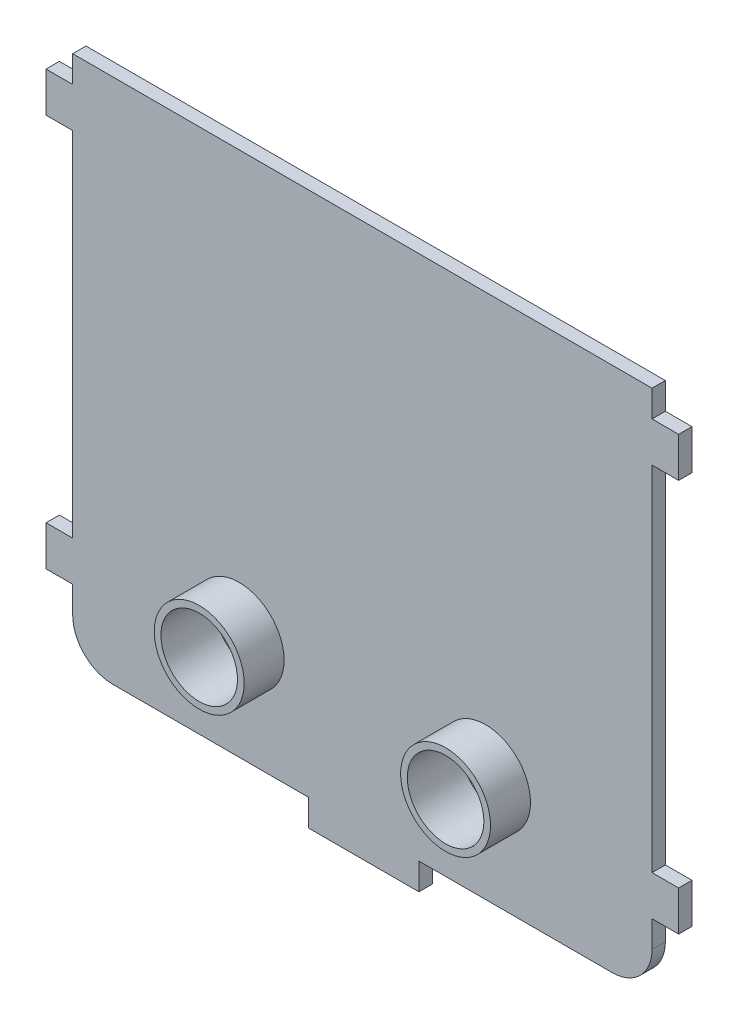
ISO-10303-21;
HEADER;
FILE_DESCRIPTION(('STEP AP214'),'2;1');
FILE_NAME('part.step','',(''),(''),'','','');
FILE_SCHEMA(('AUTOMOTIVE_DESIGN { 1 0 10303 214 1 1 1 1 }'));
ENDSEC;
DATA;
#1=APPLICATION_CONTEXT('core data for automotive mechanical design processes');
#2=APPLICATION_PROTOCOL_DEFINITION('international standard','automotive_design',2000,#1);
#3=PRODUCT_CONTEXT('',#1,'mechanical');
#4=PRODUCT('Part','Part','',(#3));
#5=PRODUCT_RELATED_PRODUCT_CATEGORY('part','',(#4));
#6=PRODUCT_DEFINITION_FORMATION('','',#4);
#7=PRODUCT_DEFINITION_CONTEXT('part definition',#1,'design');
#8=PRODUCT_DEFINITION('design','',#6,#7);
#9=PRODUCT_DEFINITION_SHAPE('','',#8);
#10=(LENGTH_UNIT() NAMED_UNIT(*) SI_UNIT(.MILLI.,.METRE.));
#11=(NAMED_UNIT(*) PLANE_ANGLE_UNIT() SI_UNIT($,.RADIAN.));
#12=(NAMED_UNIT(*) SI_UNIT($,.STERADIAN.) SOLID_ANGLE_UNIT());
#13=UNCERTAINTY_MEASURE_WITH_UNIT(LENGTH_MEASURE(1.E-05),#10,'distance_accuracy_value','');
#14=(GEOMETRIC_REPRESENTATION_CONTEXT(3) GLOBAL_UNCERTAINTY_ASSIGNED_CONTEXT((#13)) GLOBAL_UNIT_ASSIGNED_CONTEXT((#10,
#11,#12)) REPRESENTATION_CONTEXT('',''));
#15=CARTESIAN_POINT('',(0.,0.,0.));
#16=DIRECTION('',(0.,0.,1.));
#17=DIRECTION('',(1.,0.,0.));
#18=AXIS2_PLACEMENT_3D('',#15,#16,#17);
#19=CARTESIAN_POINT('',(21.75,-19.75,1.));
#20=DIRECTION('',(0.,1.,0.));
#21=DIRECTION('',(-1.,0.,0.));
#22=AXIS2_PLACEMENT_3D('',#19,#20,#21);
#23=PLANE('',#22);
#24=DIRECTION('',(1.,0.,0.));
#25=VECTOR('',#24,1.);
#26=CARTESIAN_POINT('',(21.75,-19.75,1.));
#27=LINE('',#26,#25);
#28=CARTESIAN_POINT('',(-18.75,-19.75,1.));
#29=VERTEX_POINT('',#28);
#30=CARTESIAN_POINT('',(-4.04955642280387,-19.75,1.));
#31=VERTEX_POINT('',#30);
#32=EDGE_CURVE('E352',#29,#31,#27,.T.);
#33=ORIENTED_EDGE('',*,*,#32,.F.);
#34=DIRECTION('',(0.,0.,-1.));
#35=VECTOR('',#34,1.);
#36=CARTESIAN_POINT('',(-18.75,-19.75,1.));
#37=LINE('',#36,#35);
#38=CARTESIAN_POINT('',(-18.75,-19.75,0.));
#39=VERTEX_POINT('',#38);
#40=EDGE_CURVE('E378',#29,#39,#37,.T.);
#41=ORIENTED_EDGE('',*,*,#40,.T.);
#42=DIRECTION('',(1.,0.,0.));
#43=VECTOR('',#42,1.);
#44=CARTESIAN_POINT('',(21.75,-19.75,0.));
#45=LINE('',#44,#43);
#46=CARTESIAN_POINT('',(-4.04955642280387,-19.75,0.));
#47=VERTEX_POINT('',#46);
#48=EDGE_CURVE('E365',#39,#47,#45,.T.);
#49=ORIENTED_EDGE('',*,*,#48,.T.);
#50=DIRECTION('',(0.,0.,-1.));
#51=VECTOR('',#50,1.);
#52=CARTESIAN_POINT('',(-4.04955642280387,-19.75,1.));
#53=LINE('',#52,#51);
#54=EDGE_CURVE('E231',#31,#47,#53,.T.);
#55=ORIENTED_EDGE('',*,*,#54,.F.);
#56=EDGE_LOOP('',(#33,#41,#49,#55));
#57=FACE_BOUND('',#56,.T.);
#58=ADVANCED_FACE('F33',(#57),#23,.F.);
#59=CARTESIAN_POINT('',(4.24999999999999,-19.75,0.));
#60=VERTEX_POINT('',#59);
#61=CARTESIAN_POINT('',(18.75,-19.75,0.));
#62=VERTEX_POINT('',#61);
#63=EDGE_CURVE('E363',#60,#62,#45,.T.);
#64=ORIENTED_EDGE('',*,*,#63,.T.);
#65=DIRECTION('',(0.,0.,-1.));
#66=VECTOR('',#65,1.);
#67=CARTESIAN_POINT('',(18.75,-19.75,1.));
#68=LINE('',#67,#66);
#69=CARTESIAN_POINT('',(18.75,-19.75,1.));
#70=VERTEX_POINT('',#69);
#71=EDGE_CURVE('E11',#62,#70,#68,.F.);
#72=ORIENTED_EDGE('',*,*,#71,.T.);
#73=CARTESIAN_POINT('',(4.24999999999999,-19.75,1.));
#74=VERTEX_POINT('',#73);
#75=EDGE_CURVE('E349',#74,#70,#27,.T.);
#76=ORIENTED_EDGE('',*,*,#75,.F.);
#77=DIRECTION('',(0.,0.,1.));
#78=VECTOR('',#77,1.);
#79=CARTESIAN_POINT('',(4.24999999999999,-19.75,1.));
#80=LINE('',#79,#78);
#81=EDGE_CURVE('E227',#60,#74,#80,.T.);
#82=ORIENTED_EDGE('',*,*,#81,.F.);
#83=EDGE_LOOP('',(#64,#72,#76,#82));
#84=FACE_BOUND('',#83,.T.);
#85=ADVANCED_FACE('F481',(#84),#23,.F.);
#86=CARTESIAN_POINT('',(-21.75,-19.75,1.));
#87=DIRECTION('',(1.,0.,0.));
#88=DIRECTION('',(0.,0.,-1.));
#89=AXIS2_PLACEMENT_3D('',#86,#87,#88);
#90=PLANE('',#89);
#91=DIRECTION('',(0.,0.,1.));
#92=VECTOR('',#91,1.);
#93=CARTESIAN_POINT('',(-21.75,14.75,0.));
#94=LINE('',#93,#92);
#95=CARTESIAN_POINT('',(-21.75,14.75,0.));
#96=VERTEX_POINT('',#95);
#97=CARTESIAN_POINT('',(-21.75,14.75,1.));
#98=VERTEX_POINT('',#97);
#99=EDGE_CURVE('E232',#96,#98,#94,.T.);
#100=ORIENTED_EDGE('',*,*,#99,.F.);
#101=DIRECTION('',(0.,-1.,0.));
#102=VECTOR('',#101,1.);
#103=CARTESIAN_POINT('',(-21.75,-19.75,0.));
#104=LINE('',#103,#102);
#105=CARTESIAN_POINT('',(-21.75,-11.75,0.));
#106=VERTEX_POINT('',#105);
#107=EDGE_CURVE('E364',#96,#106,#104,.T.);
#108=ORIENTED_EDGE('',*,*,#107,.T.);
#109=DIRECTION('',(0.,0.,-1.));
#110=VECTOR('',#109,1.);
#111=CARTESIAN_POINT('',(-21.75,-11.75,0.));
#112=LINE('',#111,#110);
#113=CARTESIAN_POINT('',(-21.75,-11.75,1.));
#114=VERTEX_POINT('',#113);
#115=EDGE_CURVE('E269',#114,#106,#112,.T.);
#116=ORIENTED_EDGE('',*,*,#115,.F.);
#117=DIRECTION('',(0.,-1.,0.));
#118=VECTOR('',#117,1.);
#119=CARTESIAN_POINT('',(-21.75,-19.75,1.));
#120=LINE('',#119,#118);
#121=EDGE_CURVE('E350',#98,#114,#120,.T.);
#122=ORIENTED_EDGE('',*,*,#121,.F.);
#123=EDGE_LOOP('',(#100,#108,#116,#122));
#124=FACE_BOUND('',#123,.T.);
#125=ADVANCED_FACE('F448',(#124),#90,.F.);
#126=DIRECTION('',(0.,0.,-1.));
#127=VECTOR('',#126,1.);
#128=CARTESIAN_POINT('',(-21.75,17.75,0.));
#129=LINE('',#128,#127);
#130=CARTESIAN_POINT('',(-21.75,17.75,1.));
#131=VERTEX_POINT('',#130);
#132=CARTESIAN_POINT('',(-21.75,17.75,0.));
#133=VERTEX_POINT('',#132);
#134=EDGE_CURVE('E235',#131,#133,#129,.T.);
#135=ORIENTED_EDGE('',*,*,#134,.F.);
#136=CARTESIAN_POINT('',(-21.75,19.75,1.));
#137=VERTEX_POINT('',#136);
#138=EDGE_CURVE('E346',#137,#131,#120,.T.);
#139=ORIENTED_EDGE('',*,*,#138,.F.);
#140=DIRECTION('',(0.,0.,-1.));
#141=VECTOR('',#140,1.);
#142=CARTESIAN_POINT('',(-21.75,19.75,1.));
#143=LINE('',#142,#141);
#144=CARTESIAN_POINT('',(-21.75,19.75,0.));
#145=VERTEX_POINT('',#144);
#146=EDGE_CURVE('E360',#137,#145,#143,.T.);
#147=ORIENTED_EDGE('',*,*,#146,.T.);
#148=EDGE_CURVE('E361',#145,#133,#104,.T.);
#149=ORIENTED_EDGE('',*,*,#148,.T.);
#150=EDGE_LOOP('',(#135,#139,#147,#149));
#151=FACE_BOUND('',#150,.T.);
#152=ADVANCED_FACE('F430',(#151),#90,.F.);
#153=CARTESIAN_POINT('',(-21.75,-14.75,0.));
#154=VERTEX_POINT('',#153);
#155=CARTESIAN_POINT('',(-21.75,-16.75,0.));
#156=VERTEX_POINT('',#155);
#157=EDGE_CURVE('E345',#154,#156,#104,.T.);
#158=ORIENTED_EDGE('',*,*,#157,.T.);
#159=DIRECTION('',(0.,0.,-1.));
#160=VECTOR('',#159,1.);
#161=CARTESIAN_POINT('',(-21.75,-16.75,1.));
#162=LINE('',#161,#160);
#163=CARTESIAN_POINT('',(-21.75,-16.75,1.));
#164=VERTEX_POINT('',#163);
#165=EDGE_CURVE('E385',#156,#164,#162,.F.);
#166=ORIENTED_EDGE('',*,*,#165,.T.);
#167=CARTESIAN_POINT('',(-21.75,-14.75,1.));
#168=VERTEX_POINT('',#167);
#169=EDGE_CURVE('E351',#168,#164,#120,.T.);
#170=ORIENTED_EDGE('',*,*,#169,.F.);
#171=DIRECTION('',(0.,0.,1.));
#172=VECTOR('',#171,1.);
#173=CARTESIAN_POINT('',(-21.75,-14.75,0.));
#174=LINE('',#173,#172);
#175=EDGE_CURVE('E264',#154,#168,#174,.T.);
#176=ORIENTED_EDGE('',*,*,#175,.F.);
#177=EDGE_LOOP('',(#158,#166,#170,#176));
#178=FACE_BOUND('',#177,.T.);
#179=ADVANCED_FACE('F462',(#178),#90,.F.);
#180=CARTESIAN_POINT('',(21.75,-19.75,1.));
#181=DIRECTION('',(-1.,0.,0.));
#182=DIRECTION('',(0.,0.,1.));
#183=AXIS2_PLACEMENT_3D('',#180,#181,#182);
#184=PLANE('',#183);
#185=DIRECTION('',(0.,1.,0.));
#186=VECTOR('',#185,1.);
#187=CARTESIAN_POINT('',(21.75,-19.75,1.));
#188=LINE('',#187,#186);
#189=CARTESIAN_POINT('',(21.75,-16.75,1.));
#190=VERTEX_POINT('',#189);
#191=CARTESIAN_POINT('',(21.75,-14.75,1.));
#192=VERTEX_POINT('',#191);
#193=EDGE_CURVE('E355',#190,#192,#188,.T.);
#194=ORIENTED_EDGE('',*,*,#193,.F.);
#195=DIRECTION('',(0.,0.,-1.));
#196=VECTOR('',#195,1.);
#197=CARTESIAN_POINT('',(21.75,-16.75,1.));
#198=LINE('',#197,#196);
#199=CARTESIAN_POINT('',(21.75,-16.75,0.));
#200=VERTEX_POINT('',#199);
#201=EDGE_CURVE('E41',#190,#200,#198,.T.);
#202=ORIENTED_EDGE('',*,*,#201,.T.);
#203=DIRECTION('',(0.,1.,0.));
#204=VECTOR('',#203,1.);
#205=CARTESIAN_POINT('',(21.75,-19.75,0.));
#206=LINE('',#205,#204);
#207=CARTESIAN_POINT('',(21.75,-14.75,0.));
#208=VERTEX_POINT('',#207);
#209=EDGE_CURVE('E368',#200,#208,#206,.T.);
#210=ORIENTED_EDGE('',*,*,#209,.T.);
#211=DIRECTION('',(0.,0.,-1.));
#212=VECTOR('',#211,1.);
#213=CARTESIAN_POINT('',(21.75,-14.75,1.));
#214=LINE('',#213,#212);
#215=EDGE_CURVE('E291',#192,#208,#214,.T.);
#216=ORIENTED_EDGE('',*,*,#215,.F.);
#217=EDGE_LOOP('',(#194,#202,#210,#216));
#218=FACE_BOUND('',#217,.T.);
#219=ADVANCED_FACE('F393',(#218),#184,.F.);
#220=DIRECTION('',(0.,0.,1.));
#221=VECTOR('',#220,1.);
#222=CARTESIAN_POINT('',(21.75,-11.75,1.));
#223=LINE('',#222,#221);
#224=CARTESIAN_POINT('',(21.75,-11.75,0.));
#225=VERTEX_POINT('',#224);
#226=CARTESIAN_POINT('',(21.75,-11.75,1.));
#227=VERTEX_POINT('',#226);
#228=EDGE_CURVE('E296',#225,#227,#223,.T.);
#229=ORIENTED_EDGE('',*,*,#228,.F.);
#230=CARTESIAN_POINT('',(21.75,14.75,0.));
#231=VERTEX_POINT('',#230);
#232=EDGE_CURVE('E371',#225,#231,#206,.T.);
#233=ORIENTED_EDGE('',*,*,#232,.T.);
#234=DIRECTION('',(0.,0.,-1.));
#235=VECTOR('',#234,1.);
#236=CARTESIAN_POINT('',(21.75,14.75,1.00000000000001));
#237=LINE('',#236,#235);
#238=CARTESIAN_POINT('',(21.75,14.75,1.));
#239=VERTEX_POINT('',#238);
#240=EDGE_CURVE('E318',#239,#231,#237,.T.);
#241=ORIENTED_EDGE('',*,*,#240,.F.);
#242=EDGE_CURVE('E358',#227,#239,#188,.T.);
#243=ORIENTED_EDGE('',*,*,#242,.F.);
#244=EDGE_LOOP('',(#229,#233,#241,#243));
#245=FACE_BOUND('',#244,.T.);
#246=ADVANCED_FACE('F413',(#245),#184,.F.);
#247=DIRECTION('',(0.,0.,1.));
#248=VECTOR('',#247,1.);
#249=CARTESIAN_POINT('',(21.75,17.75,1.00000000000001));
#250=LINE('',#249,#248);
#251=CARTESIAN_POINT('',(21.75,17.75,0.));
#252=VERTEX_POINT('',#251);
#253=CARTESIAN_POINT('',(21.75,17.75,1.));
#254=VERTEX_POINT('',#253);
#255=EDGE_CURVE('E323',#252,#254,#250,.T.);
#256=ORIENTED_EDGE('',*,*,#255,.F.);
#257=CARTESIAN_POINT('',(21.75,19.75,0.));
#258=VERTEX_POINT('',#257);
#259=EDGE_CURVE('E367',#252,#258,#206,.T.);
#260=ORIENTED_EDGE('',*,*,#259,.T.);
#261=DIRECTION('',(0.,0.,-1.));
#262=VECTOR('',#261,1.);
#263=CARTESIAN_POINT('',(21.75,19.75,1.));
#264=LINE('',#263,#262);
#265=CARTESIAN_POINT('',(21.75,19.75,1.));
#266=VERTEX_POINT('',#265);
#267=EDGE_CURVE('E375',#266,#258,#264,.T.);
#268=ORIENTED_EDGE('',*,*,#267,.F.);
#269=EDGE_CURVE('E354',#254,#266,#188,.T.);
#270=ORIENTED_EDGE('',*,*,#269,.F.);
#271=EDGE_LOOP('',(#256,#260,#268,#270));
#272=FACE_BOUND('',#271,.T.);
#273=ADVANCED_FACE('F422',(#272),#184,.F.);
#274=CARTESIAN_POINT('',(21.75,19.75,1.));
#275=DIRECTION('',(0.,-1.,0.));
#276=DIRECTION('',(1.,0.,0.));
#277=AXIS2_PLACEMENT_3D('',#274,#275,#276);
#278=PLANE('',#277);
#279=DIRECTION('',(-1.,0.,0.));
#280=VECTOR('',#279,1.);
#281=CARTESIAN_POINT('',(21.75,19.75,0.));
#282=LINE('',#281,#280);
#283=EDGE_CURVE('E370',#258,#145,#282,.T.);
#284=ORIENTED_EDGE('',*,*,#283,.T.);
#285=ORIENTED_EDGE('',*,*,#146,.F.);
#286=DIRECTION('',(-1.,0.,0.));
#287=VECTOR('',#286,1.);
#288=CARTESIAN_POINT('',(21.75,19.75,1.));
#289=LINE('',#288,#287);
#290=EDGE_CURVE('E357',#266,#137,#289,.T.);
#291=ORIENTED_EDGE('',*,*,#290,.F.);
#292=ORIENTED_EDGE('',*,*,#267,.T.);
#293=EDGE_LOOP('',(#284,#285,#291,#292));
#294=FACE_BOUND('',#293,.T.);
#295=ADVANCED_FACE('F426',(#294),#278,.F.);
#296=CARTESIAN_POINT('',(0.,0.,1.));
#297=DIRECTION('',(0.,0.,1.));
#298=DIRECTION('',(1.,0.,0.));
#299=AXIS2_PLACEMENT_3D('',#296,#297,#298);
#300=PLANE('',#299);
#301=CARTESIAN_POINT('',(-9.25046454215475,-11.75,1.));
#302=DIRECTION('',(0.,0.,1.));
#303=DIRECTION('',(1.,0.,0.));
#304=AXIS2_PLACEMENT_3D('',#301,#302,#303);
#305=CIRCLE('',#304,3.375);
#306=CARTESIAN_POINT('',(-5.87546454215475,-11.75,1.));
#307=VERTEX_POINT('',#306);
#308=EDGE_CURVE('E815',#307,#307,#305,.T.);
#309=ORIENTED_EDGE('',*,*,#308,.F.);
#310=EDGE_LOOP('',(#309));
#311=FACE_BOUND('',#310,.T.);
#312=CARTESIAN_POINT('',(9.25046454215474,-11.75,1.));
#313=DIRECTION('',(0.,0.,1.));
#314=DIRECTION('',(1.,0.,0.));
#315=AXIS2_PLACEMENT_3D('',#312,#313,#314);
#316=CIRCLE('',#315,3.375);
#317=CARTESIAN_POINT('',(12.6254645421547,-11.75,1.));
#318=VERTEX_POINT('',#317);
#319=EDGE_CURVE('E814',#318,#318,#316,.T.);
#320=ORIENTED_EDGE('',*,*,#319,.F.);
#321=EDGE_LOOP('',(#320));
#322=FACE_BOUND('',#321,.T.);
#323=ORIENTED_EDGE('',*,*,#169,.T.);
#324=CARTESIAN_POINT('',(-18.75,-16.75,1.));
#325=DIRECTION('',(0.,0.,1.));
#326=DIRECTION('',(1.,0.,0.));
#327=AXIS2_PLACEMENT_3D('',#324,#325,#326);
#328=CIRCLE('',#327,3.);
#329=EDGE_CURVE('E388',#164,#29,#328,.T.);
#330=ORIENTED_EDGE('',*,*,#329,.T.);
#331=ORIENTED_EDGE('',*,*,#32,.T.);
#332=DIRECTION('',(0.,1.,0.));
#333=VECTOR('',#332,1.);
#334=CARTESIAN_POINT('',(-4.04955642280387,-21.75,1.));
#335=LINE('',#334,#333);
#336=CARTESIAN_POINT('',(-4.04955642280387,-21.75,1.));
#337=VERTEX_POINT('',#336);
#338=EDGE_CURVE('E825',#337,#31,#335,.T.);
#339=ORIENTED_EDGE('',*,*,#338,.F.);
#340=DIRECTION('',(-1.,0.,0.));
#341=VECTOR('',#340,1.);
#342=CARTESIAN_POINT('',(-4.04955642280387,-21.75,1.));
#343=LINE('',#342,#341);
#344=CARTESIAN_POINT('',(4.24999999999999,-21.75,1.));
#345=VERTEX_POINT('',#344);
#346=EDGE_CURVE('E223',#345,#337,#343,.T.);
#347=ORIENTED_EDGE('',*,*,#346,.F.);
#348=DIRECTION('',(0.,1.,0.));
#349=VECTOR('',#348,1.);
#350=CARTESIAN_POINT('',(4.24999999999999,-21.75,1.));
#351=LINE('',#350,#349);
#352=EDGE_CURVE('E237',#345,#74,#351,.T.);
#353=ORIENTED_EDGE('',*,*,#352,.T.);
#354=ORIENTED_EDGE('',*,*,#75,.T.);
#355=CARTESIAN_POINT('',(18.75,-16.75,1.));
#356=DIRECTION('',(0.,0.,1.));
#357=DIRECTION('',(1.,0.,0.));
#358=AXIS2_PLACEMENT_3D('',#355,#356,#357);
#359=CIRCLE('',#358,3.);
#360=EDGE_CURVE('E48',#70,#190,#359,.T.);
#361=ORIENTED_EDGE('',*,*,#360,.T.);
#362=ORIENTED_EDGE('',*,*,#193,.T.);
#363=DIRECTION('',(-1.,0.,0.));
#364=VECTOR('',#363,1.);
#365=CARTESIAN_POINT('',(23.75,-14.75,1.));
#366=LINE('',#365,#364);
#367=CARTESIAN_POINT('',(23.75,-14.75,1.));
#368=VERTEX_POINT('',#367);
#369=EDGE_CURVE('E315',#368,#192,#366,.T.);
#370=ORIENTED_EDGE('',*,*,#369,.F.);
#371=DIRECTION('',(0.,-1.,0.));
#372=VECTOR('',#371,1.);
#373=CARTESIAN_POINT('',(23.75,-11.75,1.));
#374=LINE('',#373,#372);
#375=CARTESIAN_POINT('',(23.75,-11.75,1.));
#376=VERTEX_POINT('',#375);
#377=EDGE_CURVE('E292',#376,#368,#374,.T.);
#378=ORIENTED_EDGE('',*,*,#377,.F.);
#379=DIRECTION('',(-1.,0.,0.));
#380=VECTOR('',#379,1.);
#381=CARTESIAN_POINT('',(23.75,-11.75,1.));
#382=LINE('',#381,#380);
#383=EDGE_CURVE('E302',#376,#227,#382,.T.);
#384=ORIENTED_EDGE('',*,*,#383,.T.);
#385=ORIENTED_EDGE('',*,*,#242,.T.);
#386=DIRECTION('',(-1.,0.,0.));
#387=VECTOR('',#386,1.);
#388=CARTESIAN_POINT('',(23.75,14.75,1.00000000000001));
#389=LINE('',#388,#387);
#390=CARTESIAN_POINT('',(23.75,14.75,1.00000000000001));
#391=VERTEX_POINT('',#390);
#392=EDGE_CURVE('E342',#391,#239,#389,.T.);
#393=ORIENTED_EDGE('',*,*,#392,.F.);
#394=DIRECTION('',(0.,-1.,0.));
#395=VECTOR('',#394,1.);
#396=CARTESIAN_POINT('',(23.75,17.75,1.00000000000001));
#397=LINE('',#396,#395);
#398=CARTESIAN_POINT('',(23.75,17.75,1.00000000000001));
#399=VERTEX_POINT('',#398);
#400=EDGE_CURVE('E319',#399,#391,#397,.T.);
#401=ORIENTED_EDGE('',*,*,#400,.F.);
#402=DIRECTION('',(-1.,0.,0.));
#403=VECTOR('',#402,1.);
#404=CARTESIAN_POINT('',(23.75,17.75,1.00000000000001));
#405=LINE('',#404,#403);
#406=EDGE_CURVE('E329',#399,#254,#405,.T.);
#407=ORIENTED_EDGE('',*,*,#406,.T.);
#408=ORIENTED_EDGE('',*,*,#269,.T.);
#409=ORIENTED_EDGE('',*,*,#290,.T.);
#410=ORIENTED_EDGE('',*,*,#138,.T.);
#411=DIRECTION('',(1.,0.,0.));
#412=VECTOR('',#411,1.);
#413=CARTESIAN_POINT('',(-23.75,17.75,1.));
#414=LINE('',#413,#412);
#415=CARTESIAN_POINT('',(-23.75,17.75,1.));
#416=VERTEX_POINT('',#415);
#417=EDGE_CURVE('E255',#416,#131,#414,.T.);
#418=ORIENTED_EDGE('',*,*,#417,.F.);
#419=DIRECTION('',(0.,1.,0.));
#420=VECTOR('',#419,1.);
#421=CARTESIAN_POINT('',(-23.75,17.75,1.));
#422=LINE('',#421,#420);
#423=CARTESIAN_POINT('',(-23.75,14.75,1.));
#424=VERTEX_POINT('',#423);
#425=EDGE_CURVE('E246',#424,#416,#422,.T.);
#426=ORIENTED_EDGE('',*,*,#425,.F.);
#427=DIRECTION('',(1.,0.,0.));
#428=VECTOR('',#427,1.);
#429=CARTESIAN_POINT('',(-23.75,14.75,1.));
#430=LINE('',#429,#428);
#431=EDGE_CURVE('E258',#424,#98,#430,.T.);
#432=ORIENTED_EDGE('',*,*,#431,.T.);
#433=ORIENTED_EDGE('',*,*,#121,.T.);
#434=DIRECTION('',(1.,0.,0.));
#435=VECTOR('',#434,1.);
#436=CARTESIAN_POINT('',(-23.75,-11.75,1.));
#437=LINE('',#436,#435);
#438=CARTESIAN_POINT('',(-23.75,-11.75,1.));
#439=VERTEX_POINT('',#438);
#440=EDGE_CURVE('E282',#439,#114,#437,.T.);
#441=ORIENTED_EDGE('',*,*,#440,.F.);
#442=DIRECTION('',(0.,1.,0.));
#443=VECTOR('',#442,1.);
#444=CARTESIAN_POINT('',(-23.75,-11.75,1.));
#445=LINE('',#444,#443);
#446=CARTESIAN_POINT('',(-23.75,-14.75,1.));
#447=VERTEX_POINT('',#446);
#448=EDGE_CURVE('E271',#447,#439,#445,.T.);
#449=ORIENTED_EDGE('',*,*,#448,.F.);
#450=DIRECTION('',(1.,0.,0.));
#451=VECTOR('',#450,1.);
#452=CARTESIAN_POINT('',(-23.75,-14.75,1.));
#453=LINE('',#452,#451);
#454=EDGE_CURVE('E285',#447,#168,#453,.T.);
#455=ORIENTED_EDGE('',*,*,#454,.T.);
#456=EDGE_LOOP('',(#323,#330,#331,#339,#347,#353,#354,#361,#362,#370,#378,#384,#385,#393,#401,
#407,#408,#409,#410,#418,#426,#432,#433,#441,#449,#455));
#457=FACE_BOUND('',#456,.T.);
#458=ADVANCED_FACE('F404',(#311,#322,#457),#300,.T.);
#459=CARTESIAN_POINT('',(0.,0.,0.));
#460=DIRECTION('',(0.,0.,1.));
#461=DIRECTION('',(1.,0.,0.));
#462=AXIS2_PLACEMENT_3D('',#459,#460,#461);
#463=PLANE('',#462);
#464=CARTESIAN_POINT('',(-9.25046454215475,-11.75,0.));
#465=DIRECTION('',(0.,0.,1.));
#466=DIRECTION('',(1.,0.,0.));
#467=AXIS2_PLACEMENT_3D('',#464,#465,#466);
#468=CIRCLE('',#467,2.875);
#469=CARTESIAN_POINT('',(-6.37546454215475,-11.75,0.));
#470=VERTEX_POINT('',#469);
#471=EDGE_CURVE('E799',#470,#470,#468,.T.);
#472=ORIENTED_EDGE('',*,*,#471,.T.);
#473=EDGE_LOOP('',(#472));
#474=FACE_BOUND('',#473,.T.);
#475=CARTESIAN_POINT('',(9.25046454215474,-11.75,0.));
#476=DIRECTION('',(0.,0.,1.));
#477=DIRECTION('',(1.,0.,0.));
#478=AXIS2_PLACEMENT_3D('',#475,#476,#477);
#479=CIRCLE('',#478,2.875);
#480=CARTESIAN_POINT('',(12.1254645421547,-11.75,0.));
#481=VERTEX_POINT('',#480);
#482=EDGE_CURVE('E801',#481,#481,#479,.T.);
#483=ORIENTED_EDGE('',*,*,#482,.T.);
#484=EDGE_LOOP('',(#483));
#485=FACE_BOUND('',#484,.T.);
#486=ORIENTED_EDGE('',*,*,#48,.F.);
#487=CARTESIAN_POINT('',(-18.75,-16.75,0.));
#488=DIRECTION('',(0.,0.,1.));
#489=DIRECTION('',(1.,0.,0.));
#490=AXIS2_PLACEMENT_3D('',#487,#488,#489);
#491=CIRCLE('',#490,3.);
#492=EDGE_CURVE('E383',#39,#156,#491,.F.);
#493=ORIENTED_EDGE('',*,*,#492,.T.);
#494=ORIENTED_EDGE('',*,*,#157,.F.);
#495=DIRECTION('',(1.,0.,0.));
#496=VECTOR('',#495,1.);
#497=CARTESIAN_POINT('',(-23.75,-14.75,0.));
#498=LINE('',#497,#496);
#499=CARTESIAN_POINT('',(-23.75,-14.75,0.));
#500=VERTEX_POINT('',#499);
#501=EDGE_CURVE('E288',#500,#154,#498,.T.);
#502=ORIENTED_EDGE('',*,*,#501,.F.);
#503=DIRECTION('',(0.,-1.,0.));
#504=VECTOR('',#503,1.);
#505=CARTESIAN_POINT('',(-23.75,-11.75,0.));
#506=LINE('',#505,#504);
#507=CARTESIAN_POINT('',(-23.75,-11.75,0.));
#508=VERTEX_POINT('',#507);
#509=EDGE_CURVE('E265',#508,#500,#506,.T.);
#510=ORIENTED_EDGE('',*,*,#509,.F.);
#511=DIRECTION('',(1.,0.,0.));
#512=VECTOR('',#511,1.);
#513=CARTESIAN_POINT('',(-23.75,-11.75,0.));
#514=LINE('',#513,#512);
#515=EDGE_CURVE('E275',#508,#106,#514,.T.);
#516=ORIENTED_EDGE('',*,*,#515,.T.);
#517=ORIENTED_EDGE('',*,*,#107,.F.);
#518=DIRECTION('',(1.,0.,0.));
#519=VECTOR('',#518,1.);
#520=CARTESIAN_POINT('',(-23.75,14.75,0.));
#521=LINE('',#520,#519);
#522=CARTESIAN_POINT('',(-23.75,14.75,0.));
#523=VERTEX_POINT('',#522);
#524=EDGE_CURVE('E261',#523,#96,#521,.T.);
#525=ORIENTED_EDGE('',*,*,#524,.F.);
#526=DIRECTION('',(0.,-1.,0.));
#527=VECTOR('',#526,1.);
#528=CARTESIAN_POINT('',(-23.75,17.75,0.));
#529=LINE('',#528,#527);
#530=CARTESIAN_POINT('',(-23.75,17.75,0.));
#531=VERTEX_POINT('',#530);
#532=EDGE_CURVE('E241',#531,#523,#529,.T.);
#533=ORIENTED_EDGE('',*,*,#532,.F.);
#534=DIRECTION('',(1.,0.,0.));
#535=VECTOR('',#534,1.);
#536=CARTESIAN_POINT('',(-23.75,17.75,0.));
#537=LINE('',#536,#535);
#538=EDGE_CURVE('E249',#531,#133,#537,.T.);
#539=ORIENTED_EDGE('',*,*,#538,.T.);
#540=ORIENTED_EDGE('',*,*,#148,.F.);
#541=ORIENTED_EDGE('',*,*,#283,.F.);
#542=ORIENTED_EDGE('',*,*,#259,.F.);
#543=DIRECTION('',(-1.,0.,0.));
#544=VECTOR('',#543,1.);
#545=CARTESIAN_POINT('',(23.75,17.75,0.));
#546=LINE('',#545,#544);
#547=CARTESIAN_POINT('',(23.75,17.75,0.));
#548=VERTEX_POINT('',#547);
#549=EDGE_CURVE('E336',#548,#252,#546,.T.);
#550=ORIENTED_EDGE('',*,*,#549,.F.);
#551=DIRECTION('',(0.,1.,0.));
#552=VECTOR('',#551,1.);
#553=CARTESIAN_POINT('',(23.75,17.75,0.));
#554=LINE('',#553,#552);
#555=CARTESIAN_POINT('',(23.75,14.75,0.));
#556=VERTEX_POINT('',#555);
#557=EDGE_CURVE('E325',#556,#548,#554,.T.);
#558=ORIENTED_EDGE('',*,*,#557,.F.);
#559=DIRECTION('',(-1.,0.,0.));
#560=VECTOR('',#559,1.);
#561=CARTESIAN_POINT('',(23.75,14.75,0.));
#562=LINE('',#561,#560);
#563=EDGE_CURVE('E339',#556,#231,#562,.T.);
#564=ORIENTED_EDGE('',*,*,#563,.T.);
#565=ORIENTED_EDGE('',*,*,#232,.F.);
#566=DIRECTION('',(-1.,0.,0.));
#567=VECTOR('',#566,1.);
#568=CARTESIAN_POINT('',(23.75,-11.75,0.));
#569=LINE('',#568,#567);
#570=CARTESIAN_POINT('',(23.75,-11.75,0.));
#571=VERTEX_POINT('',#570);
#572=EDGE_CURVE('E309',#571,#225,#569,.T.);
#573=ORIENTED_EDGE('',*,*,#572,.F.);
#574=DIRECTION('',(0.,1.,0.));
#575=VECTOR('',#574,1.);
#576=CARTESIAN_POINT('',(23.75,-11.75,0.));
#577=LINE('',#576,#575);
#578=CARTESIAN_POINT('',(23.75,-14.75,0.));
#579=VERTEX_POINT('',#578);
#580=EDGE_CURVE('E298',#579,#571,#577,.T.);
#581=ORIENTED_EDGE('',*,*,#580,.F.);
#582=DIRECTION('',(-1.,0.,0.));
#583=VECTOR('',#582,1.);
#584=CARTESIAN_POINT('',(23.75,-14.75,0.));
#585=LINE('',#584,#583);
#586=EDGE_CURVE('E312',#579,#208,#585,.T.);
#587=ORIENTED_EDGE('',*,*,#586,.T.);
#588=ORIENTED_EDGE('',*,*,#209,.F.);
#589=CARTESIAN_POINT('',(18.75,-16.75,0.));
#590=DIRECTION('',(0.,0.,1.));
#591=DIRECTION('',(1.,0.,0.));
#592=AXIS2_PLACEMENT_3D('',#589,#590,#591);
#593=CIRCLE('',#592,3.);
#594=EDGE_CURVE('E381',#200,#62,#593,.F.);
#595=ORIENTED_EDGE('',*,*,#594,.T.);
#596=ORIENTED_EDGE('',*,*,#63,.F.);
#597=DIRECTION('',(0.,1.,0.));
#598=VECTOR('',#597,1.);
#599=CARTESIAN_POINT('',(4.24999999999999,-21.75,0.));
#600=LINE('',#599,#598);
#601=CARTESIAN_POINT('',(4.24999999999999,-21.75,0.));
#602=VERTEX_POINT('',#601);
#603=EDGE_CURVE('E214',#602,#60,#600,.T.);
#604=ORIENTED_EDGE('',*,*,#603,.F.);
#605=DIRECTION('',(1.,0.,0.));
#606=VECTOR('',#605,1.);
#607=CARTESIAN_POINT('',(-4.04955642280387,-21.75,0.));
#608=LINE('',#607,#606);
#609=CARTESIAN_POINT('',(-4.04955642280387,-21.75,0.));
#610=VERTEX_POINT('',#609);
#611=EDGE_CURVE('E205',#610,#602,#608,.T.);
#612=ORIENTED_EDGE('',*,*,#611,.F.);
#613=DIRECTION('',(0.,1.,0.));
#614=VECTOR('',#613,1.);
#615=CARTESIAN_POINT('',(-4.04955642280387,-21.75,0.));
#616=LINE('',#615,#614);
#617=EDGE_CURVE('E210',#610,#47,#616,.T.);
#618=ORIENTED_EDGE('',*,*,#617,.T.);
#619=EDGE_LOOP('',(#486,#493,#494,#502,#510,#516,#517,#525,#533,#539,#540,#541,#542,#550,#558,
#564,#565,#573,#581,#587,#588,#595,#596,#604,#612,#618));
#620=FACE_BOUND('',#619,.T.);
#621=ADVANCED_FACE('F208',(#474,#485,#620),#463,.F.);
#622=CARTESIAN_POINT('',(23.75,14.75,1.00000000000001));
#623=DIRECTION('',(0.,1.,0.));
#624=DIRECTION('',(0.,0.,1.));
#625=AXIS2_PLACEMENT_3D('',#622,#623,#624);
#626=PLANE('',#625);
#627=ORIENTED_EDGE('',*,*,#240,.T.);
#628=ORIENTED_EDGE('',*,*,#563,.F.);
#629=DIRECTION('',(0.,0.,-1.));
#630=VECTOR('',#629,1.);
#631=CARTESIAN_POINT('',(23.75,14.75,1.00000000000001));
#632=LINE('',#631,#630);
#633=EDGE_CURVE('E322',#391,#556,#632,.T.);
#634=ORIENTED_EDGE('',*,*,#633,.F.);
#635=ORIENTED_EDGE('',*,*,#392,.T.);
#636=EDGE_LOOP('',(#627,#628,#634,#635));
#637=FACE_BOUND('',#636,.T.);
#638=ADVANCED_FACE('F634',(#637),#626,.F.);
#639=CARTESIAN_POINT('',(23.75,17.75,1.00000000000001));
#640=DIRECTION('',(0.,-1.,0.));
#641=DIRECTION('',(0.,0.,-1.));
#642=AXIS2_PLACEMENT_3D('',#639,#640,#641);
#643=PLANE('',#642);
#644=ORIENTED_EDGE('',*,*,#255,.T.);
#645=ORIENTED_EDGE('',*,*,#406,.F.);
#646=DIRECTION('',(0.,0.,1.));
#647=VECTOR('',#646,1.);
#648=CARTESIAN_POINT('',(23.75,17.75,1.00000000000001));
#649=LINE('',#648,#647);
#650=EDGE_CURVE('E327',#548,#399,#649,.T.);
#651=ORIENTED_EDGE('',*,*,#650,.F.);
#652=ORIENTED_EDGE('',*,*,#549,.T.);
#653=EDGE_LOOP('',(#644,#645,#651,#652));
#654=FACE_BOUND('',#653,.T.);
#655=ADVANCED_FACE('F654',(#654),#643,.F.);
#656=CARTESIAN_POINT('',(23.75,0.,0.));
#657=DIRECTION('',(1.,0.,0.));
#658=DIRECTION('',(0.,0.,-1.));
#659=AXIS2_PLACEMENT_3D('',#656,#657,#658);
#660=PLANE('',#659);
#661=ORIENTED_EDGE('',*,*,#400,.T.);
#662=ORIENTED_EDGE('',*,*,#633,.T.);
#663=ORIENTED_EDGE('',*,*,#557,.T.);
#664=ORIENTED_EDGE('',*,*,#650,.T.);
#665=EDGE_LOOP('',(#661,#662,#663,#664));
#666=FACE_BOUND('',#665,.T.);
#667=ADVANCED_FACE('F663',(#666),#660,.T.);
#668=CARTESIAN_POINT('',(23.75,-14.75,1.));
#669=DIRECTION('',(0.,1.,0.));
#670=DIRECTION('',(0.,0.,1.));
#671=AXIS2_PLACEMENT_3D('',#668,#669,#670);
#672=PLANE('',#671);
#673=ORIENTED_EDGE('',*,*,#215,.T.);
#674=ORIENTED_EDGE('',*,*,#586,.F.);
#675=DIRECTION('',(0.,0.,-1.));
#676=VECTOR('',#675,1.);
#677=CARTESIAN_POINT('',(23.75,-14.75,1.));
#678=LINE('',#677,#676);
#679=EDGE_CURVE('E295',#368,#579,#678,.T.);
#680=ORIENTED_EDGE('',*,*,#679,.F.);
#681=ORIENTED_EDGE('',*,*,#369,.T.);
#682=EDGE_LOOP('',(#673,#674,#680,#681));
#683=FACE_BOUND('',#682,.T.);
#684=ADVANCED_FACE('F400',(#683),#672,.F.);
#685=CARTESIAN_POINT('',(23.75,-11.75,1.));
#686=DIRECTION('',(0.,-1.,0.));
#687=DIRECTION('',(0.,0.,-1.));
#688=AXIS2_PLACEMENT_3D('',#685,#686,#687);
#689=PLANE('',#688);
#690=ORIENTED_EDGE('',*,*,#228,.T.);
#691=ORIENTED_EDGE('',*,*,#383,.F.);
#692=DIRECTION('',(0.,0.,1.));
#693=VECTOR('',#692,1.);
#694=CARTESIAN_POINT('',(23.75,-11.75,1.));
#695=LINE('',#694,#693);
#696=EDGE_CURVE('E300',#571,#376,#695,.T.);
#697=ORIENTED_EDGE('',*,*,#696,.F.);
#698=ORIENTED_EDGE('',*,*,#572,.T.);
#699=EDGE_LOOP('',(#690,#691,#697,#698));
#700=FACE_BOUND('',#699,.T.);
#701=ADVANCED_FACE('F410',(#700),#689,.F.);
#702=CARTESIAN_POINT('',(23.75,0.,0.));
#703=DIRECTION('',(1.,0.,0.));
#704=DIRECTION('',(0.,0.,-1.));
#705=AXIS2_PLACEMENT_3D('',#702,#703,#704);
#706=PLANE('',#705);
#707=ORIENTED_EDGE('',*,*,#377,.T.);
#708=ORIENTED_EDGE('',*,*,#679,.T.);
#709=ORIENTED_EDGE('',*,*,#580,.T.);
#710=ORIENTED_EDGE('',*,*,#696,.T.);
#711=EDGE_LOOP('',(#707,#708,#709,#710));
#712=FACE_BOUND('',#711,.T.);
#713=ADVANCED_FACE('F407',(#712),#706,.T.);
#714=CARTESIAN_POINT('',(-23.75,-14.75,0.));
#715=DIRECTION('',(0.,1.,0.));
#716=DIRECTION('',(0.,0.,1.));
#717=AXIS2_PLACEMENT_3D('',#714,#715,#716);
#718=PLANE('',#717);
#719=ORIENTED_EDGE('',*,*,#175,.T.);
#720=ORIENTED_EDGE('',*,*,#454,.F.);
#721=DIRECTION('',(0.,0.,1.));
#722=VECTOR('',#721,1.);
#723=CARTESIAN_POINT('',(-23.75,-14.75,0.));
#724=LINE('',#723,#722);
#725=EDGE_CURVE('E268',#500,#447,#724,.T.);
#726=ORIENTED_EDGE('',*,*,#725,.F.);
#727=ORIENTED_EDGE('',*,*,#501,.T.);
#728=EDGE_LOOP('',(#719,#720,#726,#727));
#729=FACE_BOUND('',#728,.T.);
#730=ADVANCED_FACE('F464',(#729),#718,.F.);
#731=CARTESIAN_POINT('',(-23.75,-11.75,0.));
#732=DIRECTION('',(0.,-1.,0.));
#733=DIRECTION('',(0.,0.,-1.));
#734=AXIS2_PLACEMENT_3D('',#731,#732,#733);
#735=PLANE('',#734);
#736=ORIENTED_EDGE('',*,*,#115,.T.);
#737=ORIENTED_EDGE('',*,*,#515,.F.);
#738=DIRECTION('',(0.,0.,-1.));
#739=VECTOR('',#738,1.);
#740=CARTESIAN_POINT('',(-23.75,-11.75,0.));
#741=LINE('',#740,#739);
#742=EDGE_CURVE('E273',#439,#508,#741,.T.);
#743=ORIENTED_EDGE('',*,*,#742,.F.);
#744=ORIENTED_EDGE('',*,*,#440,.T.);
#745=EDGE_LOOP('',(#736,#737,#743,#744));
#746=FACE_BOUND('',#745,.T.);
#747=ADVANCED_FACE('F471',(#746),#735,.F.);
#748=CARTESIAN_POINT('',(-23.75,0.,0.));
#749=DIRECTION('',(-1.,0.,0.));
#750=DIRECTION('',(0.,0.,1.));
#751=AXIS2_PLACEMENT_3D('',#748,#749,#750);
#752=PLANE('',#751);
#753=ORIENTED_EDGE('',*,*,#509,.T.);
#754=ORIENTED_EDGE('',*,*,#725,.T.);
#755=ORIENTED_EDGE('',*,*,#448,.T.);
#756=ORIENTED_EDGE('',*,*,#742,.T.);
#757=EDGE_LOOP('',(#753,#754,#755,#756));
#758=FACE_BOUND('',#757,.T.);
#759=ADVANCED_FACE('F468',(#758),#752,.T.);
#760=CARTESIAN_POINT('',(-23.75,14.75,0.));
#761=DIRECTION('',(0.,1.,0.));
#762=DIRECTION('',(0.,0.,1.));
#763=AXIS2_PLACEMENT_3D('',#760,#761,#762);
#764=PLANE('',#763);
#765=ORIENTED_EDGE('',*,*,#99,.T.);
#766=ORIENTED_EDGE('',*,*,#431,.F.);
#767=DIRECTION('',(0.,0.,1.));
#768=VECTOR('',#767,1.);
#769=CARTESIAN_POINT('',(-23.75,14.75,0.));
#770=LINE('',#769,#768);
#771=EDGE_CURVE('E244',#523,#424,#770,.T.);
#772=ORIENTED_EDGE('',*,*,#771,.F.);
#773=ORIENTED_EDGE('',*,*,#524,.T.);
#774=EDGE_LOOP('',(#765,#766,#772,#773));
#775=FACE_BOUND('',#774,.T.);
#776=ADVANCED_FACE('F445',(#775),#764,.F.);
#777=CARTESIAN_POINT('',(-23.75,17.75,0.));
#778=DIRECTION('',(0.,-1.,0.));
#779=DIRECTION('',(0.,0.,-1.));
#780=AXIS2_PLACEMENT_3D('',#777,#778,#779);
#781=PLANE('',#780);
#782=ORIENTED_EDGE('',*,*,#134,.T.);
#783=ORIENTED_EDGE('',*,*,#538,.F.);
#784=DIRECTION('',(0.,0.,-1.));
#785=VECTOR('',#784,1.);
#786=CARTESIAN_POINT('',(-23.75,17.75,0.));
#787=LINE('',#786,#785);
#788=EDGE_CURVE('E248',#416,#531,#787,.T.);
#789=ORIENTED_EDGE('',*,*,#788,.F.);
#790=ORIENTED_EDGE('',*,*,#417,.T.);
#791=EDGE_LOOP('',(#782,#783,#789,#790));
#792=FACE_BOUND('',#791,.T.);
#793=ADVANCED_FACE('F435',(#792),#781,.F.);
#794=CARTESIAN_POINT('',(-23.75,0.,0.));
#795=DIRECTION('',(-1.,0.,0.));
#796=DIRECTION('',(0.,0.,1.));
#797=AXIS2_PLACEMENT_3D('',#794,#795,#796);
#798=PLANE('',#797);
#799=ORIENTED_EDGE('',*,*,#532,.T.);
#800=ORIENTED_EDGE('',*,*,#771,.T.);
#801=ORIENTED_EDGE('',*,*,#425,.T.);
#802=ORIENTED_EDGE('',*,*,#788,.T.);
#803=EDGE_LOOP('',(#799,#800,#801,#802));
#804=FACE_BOUND('',#803,.T.);
#805=ADVANCED_FACE('F439',(#804),#798,.T.);
#806=CARTESIAN_POINT('',(-4.04955642280387,-21.75,1.));
#807=DIRECTION('',(1.,0.,0.));
#808=DIRECTION('',(0.,1.,0.));
#809=AXIS2_PLACEMENT_3D('',#806,#807,#808);
#810=PLANE('',#809);
#811=ORIENTED_EDGE('',*,*,#54,.T.);
#812=ORIENTED_EDGE('',*,*,#617,.F.);
#813=DIRECTION('',(0.,0.,-1.));
#814=VECTOR('',#813,1.);
#815=CARTESIAN_POINT('',(-4.04955642280387,-21.75,1.));
#816=LINE('',#815,#814);
#817=EDGE_CURVE('E218',#337,#610,#816,.T.);
#818=ORIENTED_EDGE('',*,*,#817,.F.);
#819=ORIENTED_EDGE('',*,*,#338,.T.);
#820=EDGE_LOOP('',(#811,#812,#818,#819));
#821=FACE_BOUND('',#820,.T.);
#822=ADVANCED_FACE('F229',(#821),#810,.F.);
#823=CARTESIAN_POINT('',(4.24999999999999,-21.75,1.));
#824=DIRECTION('',(-1.,0.,0.));
#825=DIRECTION('',(0.,-1.,0.));
#826=AXIS2_PLACEMENT_3D('',#823,#824,#825);
#827=PLANE('',#826);
#828=ORIENTED_EDGE('',*,*,#81,.T.);
#829=ORIENTED_EDGE('',*,*,#352,.F.);
#830=DIRECTION('',(0.,0.,1.));
#831=VECTOR('',#830,1.);
#832=CARTESIAN_POINT('',(4.24999999999999,-21.75,1.));
#833=LINE('',#832,#831);
#834=EDGE_CURVE('E217',#602,#345,#833,.T.);
#835=ORIENTED_EDGE('',*,*,#834,.F.);
#836=ORIENTED_EDGE('',*,*,#603,.T.);
#837=EDGE_LOOP('',(#828,#829,#835,#836));
#838=FACE_BOUND('',#837,.T.);
#839=ADVANCED_FACE('F525',(#838),#827,.F.);
#840=CARTESIAN_POINT('',(0.,-21.75,0.));
#841=DIRECTION('',(0.,-1.,0.));
#842=DIRECTION('',(0.,0.,-1.));
#843=AXIS2_PLACEMENT_3D('',#840,#841,#842);
#844=PLANE('',#843);
#845=ORIENTED_EDGE('',*,*,#817,.T.);
#846=ORIENTED_EDGE('',*,*,#611,.T.);
#847=ORIENTED_EDGE('',*,*,#834,.T.);
#848=ORIENTED_EDGE('',*,*,#346,.T.);
#849=EDGE_LOOP('',(#845,#846,#847,#848));
#850=FACE_BOUND('',#849,.T.);
#851=ADVANCED_FACE('F221',(#850),#844,.T.);
#852=CARTESIAN_POINT('',(9.25046454215474,-11.75,4.));
#853=DIRECTION('',(0.,0.,-1.));
#854=DIRECTION('',(-1.,0.,0.));
#855=AXIS2_PLACEMENT_3D('',#852,#853,#854);
#856=CYLINDRICAL_SURFACE('',#855,3.375);
#857=CARTESIAN_POINT('',(9.25046454215474,-11.75,4.));
#858=DIRECTION('',(0.,0.,1.));
#859=DIRECTION('',(1.,0.,0.));
#860=AXIS2_PLACEMENT_3D('',#857,#858,#859);
#861=CIRCLE('',#860,3.375);
#862=CARTESIAN_POINT('',(12.6254645421547,-11.75,4.));
#863=VERTEX_POINT('',#862);
#864=EDGE_CURVE('E818',#863,#863,#861,.T.);
#865=ORIENTED_EDGE('',*,*,#864,.F.);
#866=EDGE_LOOP('',(#865));
#867=FACE_BOUND('',#866,.T.);
#868=ORIENTED_EDGE('',*,*,#319,.T.);
#869=EDGE_LOOP('',(#868));
#870=FACE_BOUND('',#869,.T.);
#871=ADVANCED_FACE('F518',(#867,#870),#856,.T.);
#872=CARTESIAN_POINT('',(9.25046454215474,-11.75,4.));
#873=DIRECTION('',(0.,0.,1.));
#874=DIRECTION('',(1.,0.,0.));
#875=AXIS2_PLACEMENT_3D('',#872,#873,#874);
#876=PLANE('',#875);
#877=CARTESIAN_POINT('',(9.25046454215474,-11.75,4.));
#878=DIRECTION('',(0.,0.,1.));
#879=DIRECTION('',(1.,0.,0.));
#880=AXIS2_PLACEMENT_3D('',#877,#878,#879);
#881=CIRCLE('',#880,2.875);
#882=CARTESIAN_POINT('',(12.1254645421547,-11.75,4.));
#883=VERTEX_POINT('',#882);
#884=EDGE_CURVE('E803',#883,#883,#881,.T.);
#885=ORIENTED_EDGE('',*,*,#884,.F.);
#886=EDGE_LOOP('',(#885));
#887=FACE_BOUND('',#886,.T.);
#888=ORIENTED_EDGE('',*,*,#864,.T.);
#889=EDGE_LOOP('',(#888));
#890=FACE_BOUND('',#889,.T.);
#891=ADVANCED_FACE('F514',(#887,#890),#876,.T.);
#892=CARTESIAN_POINT('',(-9.25046454215475,-11.75,4.));
#893=DIRECTION('',(0.,0.,-1.));
#894=DIRECTION('',(-1.,0.,0.));
#895=AXIS2_PLACEMENT_3D('',#892,#893,#894);
#896=CYLINDRICAL_SURFACE('',#895,3.375);
#897=CARTESIAN_POINT('',(-9.25046454215475,-11.75,4.));
#898=DIRECTION('',(0.,0.,1.));
#899=DIRECTION('',(1.,0.,0.));
#900=AXIS2_PLACEMENT_3D('',#897,#898,#899);
#901=CIRCLE('',#900,3.375);
#902=CARTESIAN_POINT('',(-5.87546454215475,-11.75,4.));
#903=VERTEX_POINT('',#902);
#904=EDGE_CURVE('E811',#903,#903,#901,.T.);
#905=ORIENTED_EDGE('',*,*,#904,.F.);
#906=EDGE_LOOP('',(#905));
#907=FACE_BOUND('',#906,.T.);
#908=ORIENTED_EDGE('',*,*,#308,.T.);
#909=EDGE_LOOP('',(#908));
#910=FACE_BOUND('',#909,.T.);
#911=ADVANCED_FACE('F510',(#907,#910),#896,.T.);
#912=CARTESIAN_POINT('',(-9.25046454215475,-11.75,4.));
#913=DIRECTION('',(0.,0.,1.));
#914=DIRECTION('',(1.,0.,0.));
#915=AXIS2_PLACEMENT_3D('',#912,#913,#914);
#916=PLANE('',#915);
#917=CARTESIAN_POINT('',(-9.25046454215475,-11.75,4.));
#918=DIRECTION('',(0.,0.,1.));
#919=DIRECTION('',(1.,0.,0.));
#920=AXIS2_PLACEMENT_3D('',#917,#918,#919);
#921=CIRCLE('',#920,2.875);
#922=CARTESIAN_POINT('',(-6.37546454215475,-11.75,4.));
#923=VERTEX_POINT('',#922);
#924=EDGE_CURVE('E802',#923,#923,#921,.T.);
#925=ORIENTED_EDGE('',*,*,#924,.F.);
#926=EDGE_LOOP('',(#925));
#927=FACE_BOUND('',#926,.T.);
#928=ORIENTED_EDGE('',*,*,#904,.T.);
#929=EDGE_LOOP('',(#928));
#930=FACE_BOUND('',#929,.T.);
#931=ADVANCED_FACE('F502',(#927,#930),#916,.T.);
#932=CARTESIAN_POINT('',(-9.25046454215475,-11.75,0.));
#933=DIRECTION('',(0.,0.,1.));
#934=DIRECTION('',(1.,0.,0.));
#935=AXIS2_PLACEMENT_3D('',#932,#933,#934);
#936=CYLINDRICAL_SURFACE('',#935,2.875);
#937=ORIENTED_EDGE('',*,*,#471,.F.);
#938=EDGE_LOOP('',(#937));
#939=FACE_BOUND('',#938,.T.);
#940=ORIENTED_EDGE('',*,*,#924,.T.);
#941=EDGE_LOOP('',(#940));
#942=FACE_BOUND('',#941,.T.);
#943=ADVANCED_FACE('F496',(#939,#942),#936,.F.);
#944=CARTESIAN_POINT('',(9.25046454215474,-11.75,0.));
#945=DIRECTION('',(0.,0.,1.));
#946=DIRECTION('',(1.,0.,0.));
#947=AXIS2_PLACEMENT_3D('',#944,#945,#946);
#948=CYLINDRICAL_SURFACE('',#947,2.875);
#949=ORIENTED_EDGE('',*,*,#482,.F.);
#950=EDGE_LOOP('',(#949));
#951=FACE_BOUND('',#950,.T.);
#952=ORIENTED_EDGE('',*,*,#884,.T.);
#953=EDGE_LOOP('',(#952));
#954=FACE_BOUND('',#953,.T.);
#955=ADVANCED_FACE('F491',(#951,#954),#948,.F.);
#956=CARTESIAN_POINT('',(-18.75,-16.75,1.));
#957=DIRECTION('',(0.,0.,-1.));
#958=DIRECTION('',(-1.,0.,0.));
#959=AXIS2_PLACEMENT_3D('',#956,#957,#958);
#960=CYLINDRICAL_SURFACE('',#959,3.);
#961=ORIENTED_EDGE('',*,*,#329,.F.);
#962=ORIENTED_EDGE('',*,*,#165,.F.);
#963=ORIENTED_EDGE('',*,*,#492,.F.);
#964=ORIENTED_EDGE('',*,*,#40,.F.);
#965=EDGE_LOOP('',(#961,#962,#963,#964));
#966=FACE_BOUND('',#965,.T.);
#967=ADVANCED_FACE('F457',(#966),#960,.T.);
#968=CARTESIAN_POINT('',(18.75,-16.75,1.));
#969=DIRECTION('',(0.,0.,-1.));
#970=DIRECTION('',(-1.,0.,0.));
#971=AXIS2_PLACEMENT_3D('',#968,#969,#970);
#972=CYLINDRICAL_SURFACE('',#971,3.);
#973=ORIENTED_EDGE('',*,*,#360,.F.);
#974=ORIENTED_EDGE('',*,*,#71,.F.);
#975=ORIENTED_EDGE('',*,*,#594,.F.);
#976=ORIENTED_EDGE('',*,*,#201,.F.);
#977=EDGE_LOOP('',(#973,#974,#975,#976));
#978=FACE_BOUND('',#977,.T.);
#979=ADVANCED_FACE('F35',(#978),#972,.T.);
#980=CLOSED_SHELL('',(#58,#85,#125,#152,#179,#219,#246,#273,#295,#458,#621,#638,#655,#667,#684,
#701,#713,#730,#747,#759,#776,#793,#805,#822,#839,#851,#871,#891,#911,#931,#943,#955,#967,#979));
#981=MANIFOLD_SOLID_BREP('B2',#980);
#982=ADVANCED_BREP_SHAPE_REPRESENTATION('',(#18,#981),#14);
#983=SHAPE_DEFINITION_REPRESENTATION(#9,#982);
ENDSEC;
END-ISO-10303-21;
